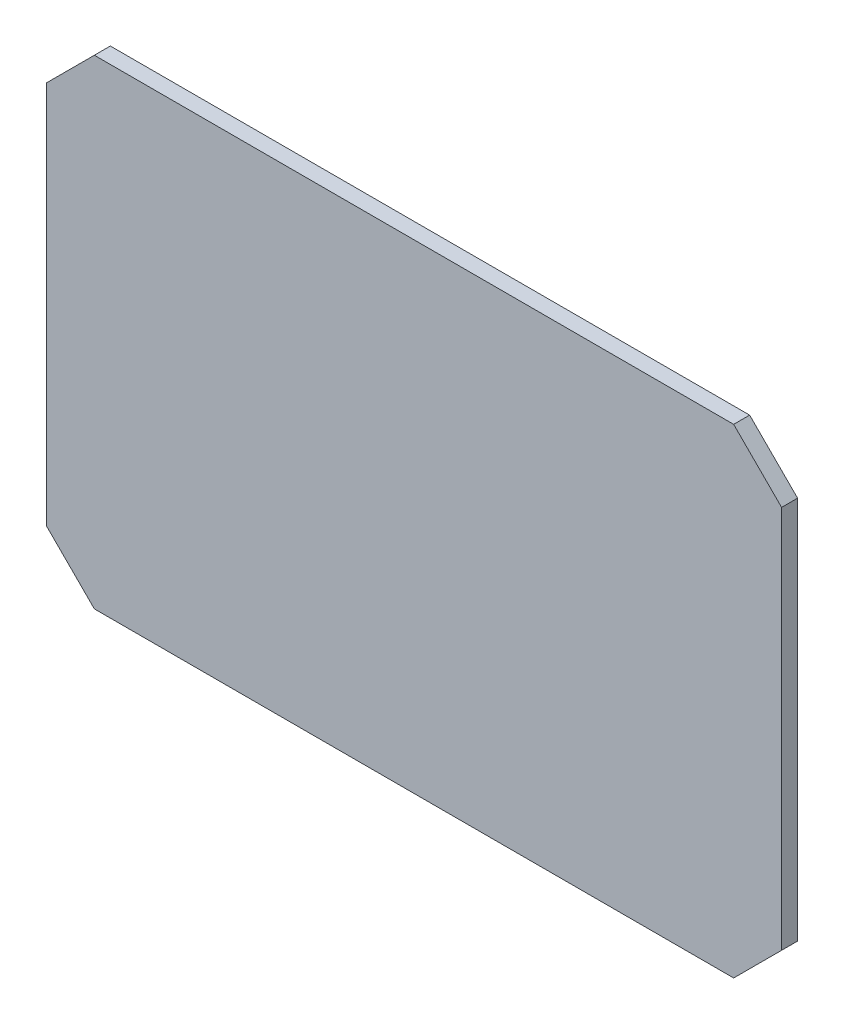
ISO-10303-21;
HEADER;
FILE_DESCRIPTION(('STEP AP214'),'2;1');
FILE_NAME('part.step','',(''),(''),'','','');
FILE_SCHEMA(('AUTOMOTIVE_DESIGN { 1 0 10303 214 1 1 1 1 }'));
ENDSEC;
DATA;
#1=APPLICATION_CONTEXT('core data for automotive mechanical design processes');
#2=APPLICATION_PROTOCOL_DEFINITION('international standard','automotive_design',2000,#1);
#3=PRODUCT_CONTEXT('',#1,'mechanical');
#4=PRODUCT('Part','Part','',(#3));
#5=PRODUCT_RELATED_PRODUCT_CATEGORY('part','',(#4));
#6=PRODUCT_DEFINITION_FORMATION('','',#4);
#7=PRODUCT_DEFINITION_CONTEXT('part definition',#1,'design');
#8=PRODUCT_DEFINITION('design','',#6,#7);
#9=PRODUCT_DEFINITION_SHAPE('','',#8);
#10=(LENGTH_UNIT() NAMED_UNIT(*) SI_UNIT(.MILLI.,.METRE.));
#11=(NAMED_UNIT(*) PLANE_ANGLE_UNIT() SI_UNIT($,.RADIAN.));
#12=(NAMED_UNIT(*) SI_UNIT($,.STERADIAN.) SOLID_ANGLE_UNIT());
#13=UNCERTAINTY_MEASURE_WITH_UNIT(LENGTH_MEASURE(1.E-05),#10,'distance_accuracy_value','');
#14=(GEOMETRIC_REPRESENTATION_CONTEXT(3) GLOBAL_UNCERTAINTY_ASSIGNED_CONTEXT((#13)) GLOBAL_UNIT_ASSIGNED_CONTEXT((#10,
#11,#12)) REPRESENTATION_CONTEXT('',''));
#15=CARTESIAN_POINT('',(0.,0.,0.));
#16=DIRECTION('',(0.,0.,1.));
#17=DIRECTION('',(1.,0.,0.));
#18=AXIS2_PLACEMENT_3D('',#15,#16,#17);
#19=CARTESIAN_POINT('',(-200.,150.,10.));
#20=DIRECTION('',(0.,-1.,0.));
#21=DIRECTION('',(0.,0.,-1.));
#22=AXIS2_PLACEMENT_3D('',#19,#20,#21);
#23=PLANE('',#22);
#24=DIRECTION('',(-1.,0.,0.));
#25=VECTOR('',#24,1.);
#26=CARTESIAN_POINT('',(-200.,150.,0.));
#27=LINE('',#26,#25);
#28=CARTESIAN_POINT('',(200.,150.,0.));
#29=VERTEX_POINT('',#28);
#30=CARTESIAN_POINT('',(-200.,150.,0.));
#31=VERTEX_POINT('',#30);
#32=EDGE_CURVE('E135',#29,#31,#27,.T.);
#33=ORIENTED_EDGE('',*,*,#32,.T.);
#34=DIRECTION('',(0.,0.,-1.));
#35=VECTOR('',#34,1.);
#36=CARTESIAN_POINT('',(-200.,150.,10.));
#37=LINE('',#36,#35);
#38=CARTESIAN_POINT('',(-200.,150.,10.));
#39=VERTEX_POINT('',#38);
#40=EDGE_CURVE('E11',#39,#31,#37,.T.);
#41=ORIENTED_EDGE('',*,*,#40,.F.);
#42=DIRECTION('',(-1.,0.,0.));
#43=VECTOR('',#42,1.);
#44=CARTESIAN_POINT('',(-200.,150.,10.));
#45=LINE('',#44,#43);
#46=CARTESIAN_POINT('',(200.,150.,10.));
#47=VERTEX_POINT('',#46);
#48=EDGE_CURVE('E149',#47,#39,#45,.T.);
#49=ORIENTED_EDGE('',*,*,#48,.F.);
#50=DIRECTION('',(0.,0.,-1.));
#51=VECTOR('',#50,1.);
#52=CARTESIAN_POINT('',(200.,150.,10.));
#53=LINE('',#52,#51);
#54=EDGE_CURVE('E131',#47,#29,#53,.T.);
#55=ORIENTED_EDGE('',*,*,#54,.T.);
#56=EDGE_LOOP('',(#33,#41,#49,#55));
#57=FACE_BOUND('',#56,.T.);
#58=ADVANCED_FACE('F39',(#57),#23,.F.);
#59=CARTESIAN_POINT('',(-230.,120.,10.));
#60=DIRECTION('',(0.707106781186548,-0.707106781186547,0.));
#61=DIRECTION('',(0.707106781186547,0.707106781186548,0.));
#62=AXIS2_PLACEMENT_3D('',#59,#60,#61);
#63=PLANE('',#62);
#64=DIRECTION('',(-0.707106781186547,-0.707106781186548,0.));
#65=VECTOR('',#64,1.);
#66=CARTESIAN_POINT('',(-230.,120.,0.));
#67=LINE('',#66,#65);
#68=CARTESIAN_POINT('',(-230.,120.,0.));
#69=VERTEX_POINT('',#68);
#70=EDGE_CURVE('E138',#31,#69,#67,.T.);
#71=ORIENTED_EDGE('',*,*,#70,.T.);
#72=DIRECTION('',(0.,0.,-1.));
#73=VECTOR('',#72,1.);
#74=CARTESIAN_POINT('',(-230.,120.,10.));
#75=LINE('',#74,#73);
#76=CARTESIAN_POINT('',(-230.,120.,10.));
#77=VERTEX_POINT('',#76);
#78=EDGE_CURVE('E47',#77,#69,#75,.T.);
#79=ORIENTED_EDGE('',*,*,#78,.F.);
#80=DIRECTION('',(-0.707106781186547,-0.707106781186548,0.));
#81=VECTOR('',#80,1.);
#82=CARTESIAN_POINT('',(-230.,120.,10.));
#83=LINE('',#82,#81);
#84=EDGE_CURVE('E98',#39,#77,#83,.T.);
#85=ORIENTED_EDGE('',*,*,#84,.F.);
#86=ORIENTED_EDGE('',*,*,#40,.T.);
#87=EDGE_LOOP('',(#71,#79,#85,#86));
#88=FACE_BOUND('',#87,.T.);
#89=ADVANCED_FACE('F184',(#88),#63,.F.);
#90=CARTESIAN_POINT('',(-230.,120.,10.));
#91=DIRECTION('',(1.,0.,0.));
#92=DIRECTION('',(0.,1.,0.));
#93=AXIS2_PLACEMENT_3D('',#90,#91,#92);
#94=PLANE('',#93);
#95=DIRECTION('',(0.,-1.,0.));
#96=VECTOR('',#95,1.);
#97=CARTESIAN_POINT('',(-230.,120.,0.));
#98=LINE('',#97,#96);
#99=CARTESIAN_POINT('',(-230.,-120.,0.));
#100=VERTEX_POINT('',#99);
#101=EDGE_CURVE('E140',#69,#100,#98,.T.);
#102=ORIENTED_EDGE('',*,*,#101,.T.);
#103=DIRECTION('',(0.,0.,-1.));
#104=VECTOR('',#103,1.);
#105=CARTESIAN_POINT('',(-230.,-120.,10.));
#106=LINE('',#105,#104);
#107=CARTESIAN_POINT('',(-230.,-120.,10.));
#108=VERTEX_POINT('',#107);
#109=EDGE_CURVE('E156',#108,#100,#106,.T.);
#110=ORIENTED_EDGE('',*,*,#109,.F.);
#111=DIRECTION('',(0.,-1.,0.));
#112=VECTOR('',#111,1.);
#113=CARTESIAN_POINT('',(-230.,120.,10.));
#114=LINE('',#113,#112);
#115=EDGE_CURVE('E164',#77,#108,#114,.T.);
#116=ORIENTED_EDGE('',*,*,#115,.F.);
#117=ORIENTED_EDGE('',*,*,#78,.T.);
#118=EDGE_LOOP('',(#102,#110,#116,#117));
#119=FACE_BOUND('',#118,.T.);
#120=ADVANCED_FACE('F162',(#119),#94,.F.);
#121=CARTESIAN_POINT('',(-230.,-120.,10.));
#122=DIRECTION('',(0.707106781186548,0.707106781186547,0.));
#123=DIRECTION('',(-0.707106781186547,0.707106781186548,0.));
#124=AXIS2_PLACEMENT_3D('',#121,#122,#123);
#125=PLANE('',#124);
#126=DIRECTION('',(0.707106781186547,-0.707106781186548,0.));
#127=VECTOR('',#126,1.);
#128=CARTESIAN_POINT('',(-230.,-120.,0.));
#129=LINE('',#128,#127);
#130=CARTESIAN_POINT('',(-200.,-150.,0.));
#131=VERTEX_POINT('',#130);
#132=EDGE_CURVE('E142',#100,#131,#129,.T.);
#133=ORIENTED_EDGE('',*,*,#132,.T.);
#134=DIRECTION('',(0.,0.,-1.));
#135=VECTOR('',#134,1.);
#136=CARTESIAN_POINT('',(-200.,-150.,10.));
#137=LINE('',#136,#135);
#138=CARTESIAN_POINT('',(-200.,-150.,10.));
#139=VERTEX_POINT('',#138);
#140=EDGE_CURVE('E153',#139,#131,#137,.T.);
#141=ORIENTED_EDGE('',*,*,#140,.F.);
#142=DIRECTION('',(0.707106781186547,-0.707106781186548,0.));
#143=VECTOR('',#142,1.);
#144=CARTESIAN_POINT('',(-230.,-120.,10.));
#145=LINE('',#144,#143);
#146=EDGE_CURVE('E176',#108,#139,#145,.T.);
#147=ORIENTED_EDGE('',*,*,#146,.F.);
#148=ORIENTED_EDGE('',*,*,#109,.T.);
#149=EDGE_LOOP('',(#133,#141,#147,#148));
#150=FACE_BOUND('',#149,.T.);
#151=ADVANCED_FACE('F172',(#150),#125,.F.);
#152=CARTESIAN_POINT('',(-200.,-150.,10.));
#153=DIRECTION('',(0.,1.,0.));
#154=DIRECTION('',(0.,0.,1.));
#155=AXIS2_PLACEMENT_3D('',#152,#153,#154);
#156=PLANE('',#155);
#157=DIRECTION('',(1.,0.,0.));
#158=VECTOR('',#157,1.);
#159=CARTESIAN_POINT('',(-200.,-150.,0.));
#160=LINE('',#159,#158);
#161=CARTESIAN_POINT('',(200.,-150.,0.));
#162=VERTEX_POINT('',#161);
#163=EDGE_CURVE('E144',#131,#162,#160,.T.);
#164=ORIENTED_EDGE('',*,*,#163,.T.);
#165=DIRECTION('',(0.,0.,-1.));
#166=VECTOR('',#165,1.);
#167=CARTESIAN_POINT('',(200.,-150.,10.));
#168=LINE('',#167,#166);
#169=CARTESIAN_POINT('',(200.,-150.,10.));
#170=VERTEX_POINT('',#169);
#171=EDGE_CURVE('E126',#170,#162,#168,.T.);
#172=ORIENTED_EDGE('',*,*,#171,.F.);
#173=DIRECTION('',(1.,0.,0.));
#174=VECTOR('',#173,1.);
#175=CARTESIAN_POINT('',(-200.,-150.,10.));
#176=LINE('',#175,#174);
#177=EDGE_CURVE('E117',#139,#170,#176,.T.);
#178=ORIENTED_EDGE('',*,*,#177,.F.);
#179=ORIENTED_EDGE('',*,*,#140,.T.);
#180=EDGE_LOOP('',(#164,#172,#178,#179));
#181=FACE_BOUND('',#180,.T.);
#182=ADVANCED_FACE('F175',(#181),#156,.F.);
#183=CARTESIAN_POINT('',(200.,-150.,10.));
#184=DIRECTION('',(-0.707106781186548,0.707106781186548,0.));
#185=DIRECTION('',(-0.707106781186548,-0.707106781186548,0.));
#186=AXIS2_PLACEMENT_3D('',#183,#184,#185);
#187=PLANE('',#186);
#188=DIRECTION('',(0.707106781186548,0.707106781186548,0.));
#189=VECTOR('',#188,1.);
#190=CARTESIAN_POINT('',(200.,-150.,0.));
#191=LINE('',#190,#189);
#192=CARTESIAN_POINT('',(230.,-120.,0.));
#193=VERTEX_POINT('',#192);
#194=EDGE_CURVE('E125',#162,#193,#191,.T.);
#195=ORIENTED_EDGE('',*,*,#194,.T.);
#196=DIRECTION('',(0.,0.,-1.));
#197=VECTOR('',#196,1.);
#198=CARTESIAN_POINT('',(230.,-120.,10.));
#199=LINE('',#198,#197);
#200=CARTESIAN_POINT('',(230.,-120.,10.));
#201=VERTEX_POINT('',#200);
#202=EDGE_CURVE('E122',#201,#193,#199,.T.);
#203=ORIENTED_EDGE('',*,*,#202,.F.);
#204=DIRECTION('',(0.707106781186548,0.707106781186548,0.));
#205=VECTOR('',#204,1.);
#206=CARTESIAN_POINT('',(200.,-150.,10.));
#207=LINE('',#206,#205);
#208=EDGE_CURVE('E111',#170,#201,#207,.T.);
#209=ORIENTED_EDGE('',*,*,#208,.F.);
#210=ORIENTED_EDGE('',*,*,#171,.T.);
#211=EDGE_LOOP('',(#195,#203,#209,#210));
#212=FACE_BOUND('',#211,.T.);
#213=ADVANCED_FACE('F123',(#212),#187,.F.);
#214=CARTESIAN_POINT('',(230.,120.,10.));
#215=DIRECTION('',(-1.,0.,0.));
#216=DIRECTION('',(0.,-1.,0.));
#217=AXIS2_PLACEMENT_3D('',#214,#215,#216);
#218=PLANE('',#217);
#219=DIRECTION('',(0.,1.,0.));
#220=VECTOR('',#219,1.);
#221=CARTESIAN_POINT('',(230.,120.,0.));
#222=LINE('',#221,#220);
#223=CARTESIAN_POINT('',(230.,120.,0.));
#224=VERTEX_POINT('',#223);
#225=EDGE_CURVE('E84',#193,#224,#222,.T.);
#226=ORIENTED_EDGE('',*,*,#225,.T.);
#227=DIRECTION('',(0.,0.,-1.));
#228=VECTOR('',#227,1.);
#229=CARTESIAN_POINT('',(230.,120.,10.));
#230=LINE('',#229,#228);
#231=CARTESIAN_POINT('',(230.,120.,10.));
#232=VERTEX_POINT('',#231);
#233=EDGE_CURVE('E127',#232,#224,#230,.T.);
#234=ORIENTED_EDGE('',*,*,#233,.F.);
#235=DIRECTION('',(0.,1.,0.));
#236=VECTOR('',#235,1.);
#237=CARTESIAN_POINT('',(230.,120.,10.));
#238=LINE('',#237,#236);
#239=EDGE_CURVE('E115',#201,#232,#238,.T.);
#240=ORIENTED_EDGE('',*,*,#239,.F.);
#241=ORIENTED_EDGE('',*,*,#202,.T.);
#242=EDGE_LOOP('',(#226,#234,#240,#241));
#243=FACE_BOUND('',#242,.T.);
#244=ADVANCED_FACE('F129',(#243),#218,.F.);
#245=CARTESIAN_POINT('',(200.,150.,10.));
#246=DIRECTION('',(-0.707106781186547,-0.707106781186549,0.));
#247=DIRECTION('',(0.707106781186549,-0.707106781186547,0.));
#248=AXIS2_PLACEMENT_3D('',#245,#246,#247);
#249=PLANE('',#248);
#250=DIRECTION('',(-0.707106781186549,0.707106781186547,0.));
#251=VECTOR('',#250,1.);
#252=CARTESIAN_POINT('',(200.,150.,0.));
#253=LINE('',#252,#251);
#254=EDGE_CURVE('E90',#224,#29,#253,.T.);
#255=ORIENTED_EDGE('',*,*,#254,.T.);
#256=ORIENTED_EDGE('',*,*,#54,.F.);
#257=DIRECTION('',(-0.707106781186549,0.707106781186547,0.));
#258=VECTOR('',#257,1.);
#259=CARTESIAN_POINT('',(200.,150.,10.));
#260=LINE('',#259,#258);
#261=EDGE_CURVE('E55',#232,#47,#260,.T.);
#262=ORIENTED_EDGE('',*,*,#261,.F.);
#263=ORIENTED_EDGE('',*,*,#233,.T.);
#264=EDGE_LOOP('',(#255,#256,#262,#263));
#265=FACE_BOUND('',#264,.T.);
#266=ADVANCED_FACE('F200',(#265),#249,.F.);
#267=CARTESIAN_POINT('',(0.,0.,10.));
#268=DIRECTION('',(0.,0.,-1.));
#269=DIRECTION('',(-1.,0.,0.));
#270=AXIS2_PLACEMENT_3D('',#267,#268,#269);
#271=PLANE('',#270);
#272=ORIENTED_EDGE('',*,*,#48,.T.);
#273=ORIENTED_EDGE('',*,*,#84,.T.);
#274=ORIENTED_EDGE('',*,*,#115,.T.);
#275=ORIENTED_EDGE('',*,*,#146,.T.);
#276=ORIENTED_EDGE('',*,*,#177,.T.);
#277=ORIENTED_EDGE('',*,*,#208,.T.);
#278=ORIENTED_EDGE('',*,*,#239,.T.);
#279=ORIENTED_EDGE('',*,*,#261,.T.);
#280=EDGE_LOOP('',(#272,#273,#274,#275,#276,#277,#278,#279));
#281=FACE_BOUND('',#280,.T.);
#282=ADVANCED_FACE('F113',(#281),#271,.F.);
#283=CARTESIAN_POINT('',(0.,0.,0.));
#284=DIRECTION('',(0.,0.,-1.));
#285=DIRECTION('',(-1.,0.,0.));
#286=AXIS2_PLACEMENT_3D('',#283,#284,#285);
#287=PLANE('',#286);
#288=ORIENTED_EDGE('',*,*,#32,.F.);
#289=ORIENTED_EDGE('',*,*,#254,.F.);
#290=ORIENTED_EDGE('',*,*,#225,.F.);
#291=ORIENTED_EDGE('',*,*,#194,.F.);
#292=ORIENTED_EDGE('',*,*,#163,.F.);
#293=ORIENTED_EDGE('',*,*,#132,.F.);
#294=ORIENTED_EDGE('',*,*,#101,.F.);
#295=ORIENTED_EDGE('',*,*,#70,.F.);
#296=EDGE_LOOP('',(#288,#289,#290,#291,#292,#293,#294,#295));
#297=FACE_BOUND('',#296,.T.);
#298=ADVANCED_FACE('F168',(#297),#287,.T.);
#299=CLOSED_SHELL('',(#58,#89,#120,#151,#182,#213,#244,#266,#282,#298));
#300=MANIFOLD_SOLID_BREP('B2',#299);
#301=ADVANCED_BREP_SHAPE_REPRESENTATION('',(#18,#300),#14);
#302=SHAPE_DEFINITION_REPRESENTATION(#9,#301);
ENDSEC;
END-ISO-10303-21;
